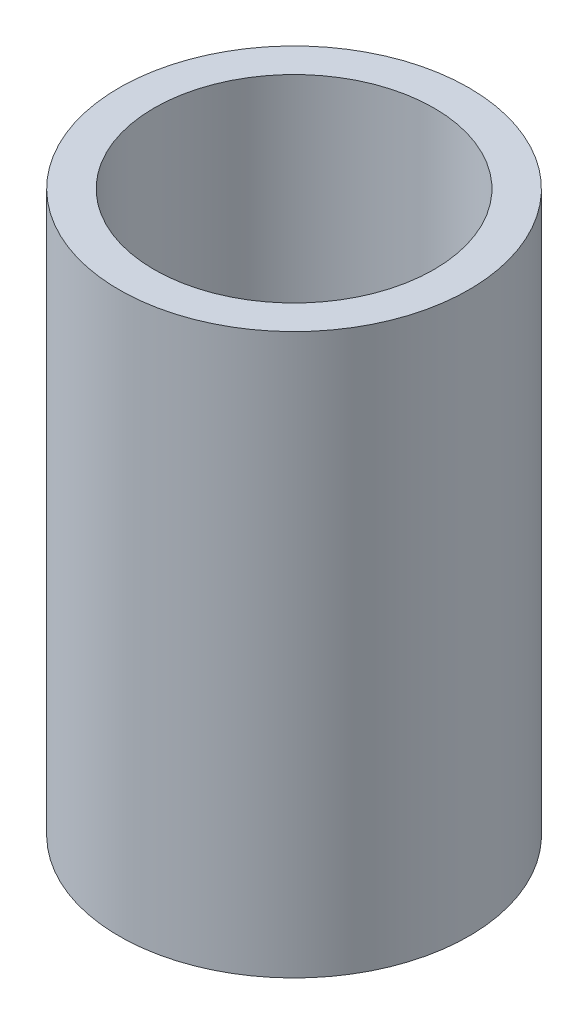
ISO-10303-21;
HEADER;
FILE_DESCRIPTION(('STEP AP214'),'2;1');
FILE_NAME('part.step','',(''),(''),'','','');
FILE_SCHEMA(('AUTOMOTIVE_DESIGN { 1 0 10303 214 1 1 1 1 }'));
ENDSEC;
DATA;
#1=APPLICATION_CONTEXT('core data for automotive mechanical design processes');
#2=APPLICATION_PROTOCOL_DEFINITION('international standard','automotive_design',2000,#1);
#3=PRODUCT_CONTEXT('',#1,'mechanical');
#4=PRODUCT('Part','Part','',(#3));
#5=PRODUCT_RELATED_PRODUCT_CATEGORY('part','',(#4));
#6=PRODUCT_DEFINITION_FORMATION('','',#4);
#7=PRODUCT_DEFINITION_CONTEXT('part definition',#1,'design');
#8=PRODUCT_DEFINITION('design','',#6,#7);
#9=PRODUCT_DEFINITION_SHAPE('','',#8);
#10=(LENGTH_UNIT() NAMED_UNIT(*) SI_UNIT(.MILLI.,.METRE.));
#11=(NAMED_UNIT(*) PLANE_ANGLE_UNIT() SI_UNIT($,.RADIAN.));
#12=(NAMED_UNIT(*) SI_UNIT($,.STERADIAN.) SOLID_ANGLE_UNIT());
#13=UNCERTAINTY_MEASURE_WITH_UNIT(LENGTH_MEASURE(1.E-05),#10,'distance_accuracy_value','');
#14=(GEOMETRIC_REPRESENTATION_CONTEXT(3) GLOBAL_UNCERTAINTY_ASSIGNED_CONTEXT((#13)) GLOBAL_UNIT_ASSIGNED_CONTEXT((#10,
#11,#12)) REPRESENTATION_CONTEXT('',''));
#15=CARTESIAN_POINT('',(0.,0.,0.));
#16=DIRECTION('',(0.,0.,1.));
#17=DIRECTION('',(1.,0.,0.));
#18=AXIS2_PLACEMENT_3D('',#15,#16,#17);
#19=CARTESIAN_POINT('',(0.,0.,0.));
#20=DIRECTION('',(0.,-1.,0.));
#21=DIRECTION('',(0.,0.,-1.));
#22=AXIS2_PLACEMENT_3D('',#19,#20,#21);
#23=CYLINDRICAL_SURFACE('',#22,6.);
#24=CARTESIAN_POINT('',(0.,0.,0.));
#25=DIRECTION('',(0.,-1.,0.));
#26=DIRECTION('',(0.,0.,-1.));
#27=AXIS2_PLACEMENT_3D('',#24,#25,#26);
#28=CIRCLE('',#27,6.);
#29=CARTESIAN_POINT('',(0.,0.,-6.));
#30=VERTEX_POINT('',#29);
#31=EDGE_CURVE('E49',#30,#30,#28,.T.);
#32=ORIENTED_EDGE('',*,*,#31,.T.);
#33=EDGE_LOOP('',(#32));
#34=FACE_BOUND('',#33,.T.);
#35=CARTESIAN_POINT('',(0.,24.,0.));
#36=DIRECTION('',(0.,-1.,0.));
#37=DIRECTION('',(0.,0.,-1.));
#38=AXIS2_PLACEMENT_3D('',#35,#36,#37);
#39=CIRCLE('',#38,6.);
#40=CARTESIAN_POINT('',(0.,24.,-6.));
#41=VERTEX_POINT('',#40);
#42=EDGE_CURVE('E10',#41,#41,#39,.T.);
#43=ORIENTED_EDGE('',*,*,#42,.F.);
#44=EDGE_LOOP('',(#43));
#45=FACE_BOUND('',#44,.T.);
#46=ADVANCED_FACE('F35',(#34,#45),#23,.F.);
#47=CARTESIAN_POINT('',(6.,24.,0.));
#48=DIRECTION('',(0.,1.,0.));
#49=DIRECTION('',(0.,0.,1.));
#50=AXIS2_PLACEMENT_3D('',#47,#48,#49);
#51=PLANE('',#50);
#52=ORIENTED_EDGE('',*,*,#42,.T.);
#53=EDGE_LOOP('',(#52));
#54=FACE_BOUND('',#53,.T.);
#55=CARTESIAN_POINT('',(0.,24.,0.));
#56=DIRECTION('',(0.,-1.,0.));
#57=DIRECTION('',(0.,0.,-1.));
#58=AXIS2_PLACEMENT_3D('',#55,#56,#57);
#59=CIRCLE('',#58,7.5);
#60=CARTESIAN_POINT('',(0.,24.,-7.5));
#61=VERTEX_POINT('',#60);
#62=EDGE_CURVE('E41',#61,#61,#59,.T.);
#63=ORIENTED_EDGE('',*,*,#62,.F.);
#64=EDGE_LOOP('',(#63));
#65=FACE_BOUND('',#64,.T.);
#66=ADVANCED_FACE('F65',(#54,#65),#51,.T.);
#67=CARTESIAN_POINT('',(0.,0.,0.));
#68=DIRECTION('',(0.,-1.,0.));
#69=DIRECTION('',(0.,0.,-1.));
#70=AXIS2_PLACEMENT_3D('',#67,#68,#69);
#71=CYLINDRICAL_SURFACE('',#70,7.5);
#72=ORIENTED_EDGE('',*,*,#62,.T.);
#73=EDGE_LOOP('',(#72));
#74=FACE_BOUND('',#73,.T.);
#75=CARTESIAN_POINT('',(0.,0.,0.));
#76=DIRECTION('',(0.,-1.,0.));
#77=DIRECTION('',(0.,0.,-1.));
#78=AXIS2_PLACEMENT_3D('',#75,#76,#77);
#79=CIRCLE('',#78,7.5);
#80=CARTESIAN_POINT('',(0.,0.,-7.5));
#81=VERTEX_POINT('',#80);
#82=EDGE_CURVE('E45',#81,#81,#79,.T.);
#83=ORIENTED_EDGE('',*,*,#82,.F.);
#84=EDGE_LOOP('',(#83));
#85=FACE_BOUND('',#84,.T.);
#86=ADVANCED_FACE('F59',(#74,#85),#71,.T.);
#87=CARTESIAN_POINT('',(6.,0.,0.));
#88=DIRECTION('',(0.,-1.,0.));
#89=DIRECTION('',(0.,0.,-1.));
#90=AXIS2_PLACEMENT_3D('',#87,#88,#89);
#91=PLANE('',#90);
#92=ORIENTED_EDGE('',*,*,#82,.T.);
#93=EDGE_LOOP('',(#92));
#94=FACE_BOUND('',#93,.T.);
#95=ORIENTED_EDGE('',*,*,#31,.F.);
#96=EDGE_LOOP('',(#95));
#97=FACE_BOUND('',#96,.T.);
#98=ADVANCED_FACE('F57',(#94,#97),#91,.T.);
#99=CLOSED_SHELL('',(#46,#66,#86,#98));
#100=MANIFOLD_SOLID_BREP('B2',#99);
#101=ADVANCED_BREP_SHAPE_REPRESENTATION('',(#18,#100),#14);
#102=SHAPE_DEFINITION_REPRESENTATION(#9,#101);
ENDSEC;
END-ISO-10303-21;
